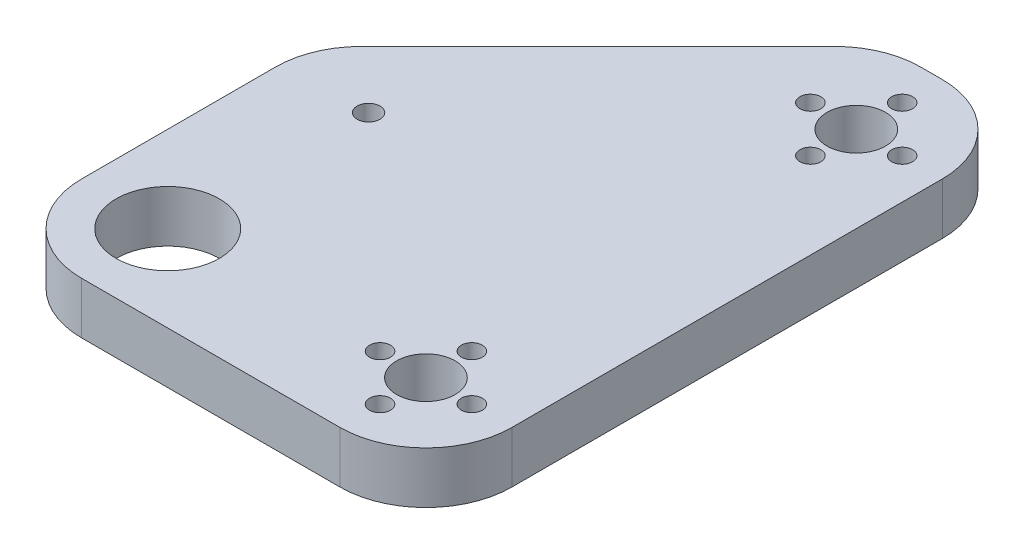
ISO-10303-21;
HEADER;
FILE_DESCRIPTION(('STEP AP214'),'2;1');
FILE_NAME('part.step','',(''),(''),'','','');
FILE_SCHEMA(('AUTOMOTIVE_DESIGN { 1 0 10303 214 1 1 1 1 }'));
ENDSEC;
DATA;
#1=APPLICATION_CONTEXT('core data for automotive mechanical design processes');
#2=APPLICATION_PROTOCOL_DEFINITION('international standard','automotive_design',2000,#1);
#3=PRODUCT_CONTEXT('',#1,'mechanical');
#4=PRODUCT('Part','Part','',(#3));
#5=PRODUCT_RELATED_PRODUCT_CATEGORY('part','',(#4));
#6=PRODUCT_DEFINITION_FORMATION('','',#4);
#7=PRODUCT_DEFINITION_CONTEXT('part definition',#1,'design');
#8=PRODUCT_DEFINITION('design','',#6,#7);
#9=PRODUCT_DEFINITION_SHAPE('','',#8);
#10=(LENGTH_UNIT() NAMED_UNIT(*) SI_UNIT(.MILLI.,.METRE.));
#11=(NAMED_UNIT(*) PLANE_ANGLE_UNIT() SI_UNIT($,.RADIAN.));
#12=(NAMED_UNIT(*) SI_UNIT($,.STERADIAN.) SOLID_ANGLE_UNIT());
#13=UNCERTAINTY_MEASURE_WITH_UNIT(LENGTH_MEASURE(1.E-05),#10,'distance_accuracy_value','');
#14=(GEOMETRIC_REPRESENTATION_CONTEXT(3) GLOBAL_UNCERTAINTY_ASSIGNED_CONTEXT((#13)) GLOBAL_UNIT_ASSIGNED_CONTEXT((#10,
#11,#12)) REPRESENTATION_CONTEXT('',''));
#15=CARTESIAN_POINT('',(0.,0.,0.));
#16=DIRECTION('',(0.,0.,1.));
#17=DIRECTION('',(1.,0.,0.));
#18=AXIS2_PLACEMENT_3D('',#15,#16,#17);
#19=CARTESIAN_POINT('',(0.,9.,0.));
#20=DIRECTION('',(1.,0.,0.));
#21=DIRECTION('',(0.,0.,-1.));
#22=AXIS2_PLACEMENT_3D('',#19,#20,#21);
#23=PLANE('',#22);
#24=DIRECTION('',(0.,0.,1.));
#25=VECTOR('',#24,1.);
#26=CARTESIAN_POINT('',(0.,9.,0.));
#27=LINE('',#26,#25);
#28=CARTESIAN_POINT('',(0.,9.,-48.7867965644036));
#29=VERTEX_POINT('',#28);
#30=CARTESIAN_POINT('',(0.,9.,-15.));
#31=VERTEX_POINT('',#30);
#32=EDGE_CURVE('E139',#29,#31,#27,.T.);
#33=ORIENTED_EDGE('',*,*,#32,.F.);
#34=DIRECTION('',(0.,1.,0.));
#35=VECTOR('',#34,1.);
#36=CARTESIAN_POINT('',(0.,0.,-48.7867965644036));
#37=LINE('',#36,#35);
#38=CARTESIAN_POINT('',(0.,0.,-48.7867965644036));
#39=VERTEX_POINT('',#38);
#40=EDGE_CURVE('E178',#29,#39,#37,.F.);
#41=ORIENTED_EDGE('',*,*,#40,.T.);
#42=DIRECTION('',(0.,0.,1.));
#43=VECTOR('',#42,1.);
#44=CARTESIAN_POINT('',(0.,0.,0.));
#45=LINE('',#44,#43);
#46=CARTESIAN_POINT('',(0.,0.,-15.));
#47=VERTEX_POINT('',#46);
#48=EDGE_CURVE('E187',#39,#47,#45,.T.);
#49=ORIENTED_EDGE('',*,*,#48,.T.);
#50=DIRECTION('',(0.,-1.,0.));
#51=VECTOR('',#50,1.);
#52=CARTESIAN_POINT('',(0.,9.,-15.));
#53=LINE('',#52,#51);
#54=EDGE_CURVE('E176',#47,#31,#53,.F.);
#55=ORIENTED_EDGE('',*,*,#54,.T.);
#56=EDGE_LOOP('',(#33,#41,#49,#55));
#57=FACE_BOUND('',#56,.T.);
#58=ADVANCED_FACE('F34',(#57),#23,.F.);
#59=CARTESIAN_POINT('',(0.,9.,0.));
#60=DIRECTION('',(0.,0.,-1.));
#61=DIRECTION('',(-1.,0.,0.));
#62=AXIS2_PLACEMENT_3D('',#59,#60,#61);
#63=PLANE('',#62);
#64=DIRECTION('',(1.,0.,0.));
#65=VECTOR('',#64,1.);
#66=CARTESIAN_POINT('',(0.,0.,0.));
#67=LINE('',#66,#65);
#68=CARTESIAN_POINT('',(15.,0.,0.));
#69=VERTEX_POINT('',#68);
#70=CARTESIAN_POINT('',(60.,0.,0.));
#71=VERTEX_POINT('',#70);
#72=EDGE_CURVE('E144',#69,#71,#67,.T.);
#73=ORIENTED_EDGE('',*,*,#72,.T.);
#74=DIRECTION('',(0.,-1.,0.));
#75=VECTOR('',#74,1.);
#76=CARTESIAN_POINT('',(60.,9.,0.));
#77=LINE('',#76,#75);
#78=CARTESIAN_POINT('',(60.,9.,0.));
#79=VERTEX_POINT('',#78);
#80=EDGE_CURVE('E11',#71,#79,#77,.F.);
#81=ORIENTED_EDGE('',*,*,#80,.T.);
#82=DIRECTION('',(1.,0.,0.));
#83=VECTOR('',#82,1.);
#84=CARTESIAN_POINT('',(0.,9.,0.));
#85=LINE('',#84,#83);
#86=CARTESIAN_POINT('',(15.,9.,0.));
#87=VERTEX_POINT('',#86);
#88=EDGE_CURVE('E142',#87,#79,#85,.T.);
#89=ORIENTED_EDGE('',*,*,#88,.F.);
#90=DIRECTION('',(0.,-1.,0.));
#91=VECTOR('',#90,1.);
#92=CARTESIAN_POINT('',(15.,9.,0.));
#93=LINE('',#92,#91);
#94=EDGE_CURVE('E42',#87,#69,#93,.T.);
#95=ORIENTED_EDGE('',*,*,#94,.T.);
#96=EDGE_LOOP('',(#73,#81,#89,#95));
#97=FACE_BOUND('',#96,.T.);
#98=ADVANCED_FACE('F183',(#97),#63,.F.);
#99=CARTESIAN_POINT('',(75.,9.,0.));
#100=DIRECTION('',(-1.,0.,0.));
#101=DIRECTION('',(0.,0.,1.));
#102=AXIS2_PLACEMENT_3D('',#99,#100,#101);
#103=PLANE('',#102);
#104=DIRECTION('',(0.,0.,-1.));
#105=VECTOR('',#104,1.);
#106=CARTESIAN_POINT('',(75.,0.,0.));
#107=LINE('',#106,#105);
#108=CARTESIAN_POINT('',(75.,0.,-15.));
#109=VERTEX_POINT('',#108);
#110=CARTESIAN_POINT('',(75.,0.,-90.));
#111=VERTEX_POINT('',#110);
#112=EDGE_CURVE('E140',#109,#111,#107,.T.);
#113=ORIENTED_EDGE('',*,*,#112,.T.);
#114=DIRECTION('',(0.,-1.,0.));
#115=VECTOR('',#114,1.);
#116=CARTESIAN_POINT('',(75.,9.,-90.));
#117=LINE('',#116,#115);
#118=CARTESIAN_POINT('',(75.,9.,-90.));
#119=VERTEX_POINT('',#118);
#120=EDGE_CURVE('E116',#111,#119,#117,.F.);
#121=ORIENTED_EDGE('',*,*,#120,.T.);
#122=DIRECTION('',(0.,0.,-1.));
#123=VECTOR('',#122,1.);
#124=CARTESIAN_POINT('',(75.,9.,0.));
#125=LINE('',#124,#123);
#126=CARTESIAN_POINT('',(75.,9.,-15.));
#127=VERTEX_POINT('',#126);
#128=EDGE_CURVE('E192',#127,#119,#125,.T.);
#129=ORIENTED_EDGE('',*,*,#128,.F.);
#130=DIRECTION('',(0.,-1.,0.));
#131=VECTOR('',#130,1.);
#132=CARTESIAN_POINT('',(75.,9.,-15.));
#133=LINE('',#132,#131);
#134=EDGE_CURVE('E121',#127,#109,#133,.T.);
#135=ORIENTED_EDGE('',*,*,#134,.T.);
#136=EDGE_LOOP('',(#113,#121,#129,#135));
#137=FACE_BOUND('',#136,.T.);
#138=ADVANCED_FACE('F292',(#137),#103,.F.);
#139=CARTESIAN_POINT('',(0.,9.,-105.));
#140=DIRECTION('',(0.,0.,1.));
#141=DIRECTION('',(1.,0.,0.));
#142=AXIS2_PLACEMENT_3D('',#139,#140,#141);
#143=PLANE('',#142);
#144=DIRECTION('',(-1.,0.,0.));
#145=VECTOR('',#144,1.);
#146=CARTESIAN_POINT('',(0.,9.,-105.));
#147=LINE('',#146,#145);
#148=CARTESIAN_POINT('',(60.,9.,-105.));
#149=VERTEX_POINT('',#148);
#150=CARTESIAN_POINT('',(56.2132034355966,9.,-105.));
#151=VERTEX_POINT('',#150);
#152=EDGE_CURVE('E132',#149,#151,#147,.T.);
#153=ORIENTED_EDGE('',*,*,#152,.F.);
#154=DIRECTION('',(0.,-1.,0.));
#155=VECTOR('',#154,1.);
#156=CARTESIAN_POINT('',(60.,9.,-105.));
#157=LINE('',#156,#155);
#158=CARTESIAN_POINT('',(60.,0.,-105.));
#159=VERTEX_POINT('',#158);
#160=EDGE_CURVE('E115',#149,#159,#157,.T.);
#161=ORIENTED_EDGE('',*,*,#160,.T.);
#162=DIRECTION('',(-1.,0.,0.));
#163=VECTOR('',#162,1.);
#164=CARTESIAN_POINT('',(0.,0.,-105.));
#165=LINE('',#164,#163);
#166=CARTESIAN_POINT('',(56.2132034355966,0.,-105.));
#167=VERTEX_POINT('',#166);
#168=EDGE_CURVE('E129',#159,#167,#165,.T.);
#169=ORIENTED_EDGE('',*,*,#168,.T.);
#170=DIRECTION('',(0.,-1.,0.));
#171=VECTOR('',#170,1.);
#172=CARTESIAN_POINT('',(56.2132034355966,9.,-105.));
#173=LINE('',#172,#171);
#174=EDGE_CURVE('E134',#167,#151,#173,.F.);
#175=ORIENTED_EDGE('',*,*,#174,.T.);
#176=EDGE_LOOP('',(#153,#161,#169,#175));
#177=FACE_BOUND('',#176,.T.);
#178=ADVANCED_FACE('F127',(#177),#143,.F.);
#179=CARTESIAN_POINT('',(0.,9.,0.));
#180=DIRECTION('',(0.,-1.,0.));
#181=DIRECTION('',(0.,0.,-1.));
#182=AXIS2_PLACEMENT_3D('',#179,#180,#181);
#183=PLANE('',#182);
#184=CARTESIAN_POINT('',(60.,9.,-98.));
#185=DIRECTION('',(0.,1.,0.));
#186=DIRECTION('',(0.,0.,1.));
#187=AXIS2_PLACEMENT_3D('',#184,#185,#186);
#188=CIRCLE('',#187,1.825);
#189=CARTESIAN_POINT('',(60.,9.,-96.175));
#190=VERTEX_POINT('',#189);
#191=EDGE_CURVE('E226',#190,#190,#188,.T.);
#192=ORIENTED_EDGE('',*,*,#191,.F.);
#193=EDGE_LOOP('',(#192));
#194=FACE_BOUND('',#193,.T.);
#195=CARTESIAN_POINT('',(60.,9.,-90.));
#196=DIRECTION('',(0.,1.,0.));
#197=DIRECTION('',(0.,0.,1.));
#198=AXIS2_PLACEMENT_3D('',#195,#196,#197);
#199=CIRCLE('',#198,5.1);
#200=CARTESIAN_POINT('',(60.,9.,-84.9));
#201=VERTEX_POINT('',#200);
#202=EDGE_CURVE('E233',#201,#201,#199,.T.);
#203=ORIENTED_EDGE('',*,*,#202,.F.);
#204=EDGE_LOOP('',(#203));
#205=FACE_BOUND('',#204,.T.);
#206=CARTESIAN_POINT('',(52.,9.,-15.));
#207=DIRECTION('',(0.,1.,0.));
#208=DIRECTION('',(0.,0.,1.));
#209=AXIS2_PLACEMENT_3D('',#206,#207,#208);
#210=CIRCLE('',#209,1.825);
#211=CARTESIAN_POINT('',(52.,9.,-13.175));
#212=VERTEX_POINT('',#211);
#213=EDGE_CURVE('E239',#212,#212,#210,.T.);
#214=ORIENTED_EDGE('',*,*,#213,.F.);
#215=EDGE_LOOP('',(#214));
#216=FACE_BOUND('',#215,.T.);
#217=CARTESIAN_POINT('',(68.,9.,-15.));
#218=DIRECTION('',(0.,1.,0.));
#219=DIRECTION('',(0.,0.,1.));
#220=AXIS2_PLACEMENT_3D('',#217,#218,#219);
#221=CIRCLE('',#220,1.82499999999999);
#222=CARTESIAN_POINT('',(68.,9.,-13.175));
#223=VERTEX_POINT('',#222);
#224=EDGE_CURVE('E245',#223,#223,#221,.T.);
#225=ORIENTED_EDGE('',*,*,#224,.F.);
#226=EDGE_LOOP('',(#225));
#227=FACE_BOUND('',#226,.T.);
#228=CARTESIAN_POINT('',(15.,9.,-50.));
#229=DIRECTION('',(0.,1.,0.));
#230=DIRECTION('',(0.,0.,1.));
#231=AXIS2_PLACEMENT_3D('',#228,#229,#230);
#232=CIRCLE('',#231,2.);
#233=CARTESIAN_POINT('',(15.,9.,-48.));
#234=VERTEX_POINT('',#233);
#235=EDGE_CURVE('E209',#234,#234,#232,.T.);
#236=ORIENTED_EDGE('',*,*,#235,.F.);
#237=EDGE_LOOP('',(#236));
#238=FACE_BOUND('',#237,.T.);
#239=CARTESIAN_POINT('',(60.,9.,-15.));
#240=DIRECTION('',(0.,1.,0.));
#241=DIRECTION('',(0.,0.,1.));
#242=AXIS2_PLACEMENT_3D('',#239,#240,#241);
#243=CIRCLE('',#242,5.1);
#244=CARTESIAN_POINT('',(60.,9.,-9.9));
#245=VERTEX_POINT('',#244);
#246=EDGE_CURVE('E202',#245,#245,#243,.T.);
#247=ORIENTED_EDGE('',*,*,#246,.F.);
#248=EDGE_LOOP('',(#247));
#249=FACE_BOUND('',#248,.T.);
#250=CARTESIAN_POINT('',(60.,9.,-23.));
#251=DIRECTION('',(0.,1.,0.));
#252=DIRECTION('',(0.,0.,1.));
#253=AXIS2_PLACEMENT_3D('',#250,#251,#252);
#254=CIRCLE('',#253,1.825);
#255=CARTESIAN_POINT('',(60.,9.,-21.175));
#256=VERTEX_POINT('',#255);
#257=EDGE_CURVE('E221',#256,#256,#254,.T.);
#258=ORIENTED_EDGE('',*,*,#257,.F.);
#259=EDGE_LOOP('',(#258));
#260=FACE_BOUND('',#259,.T.);
#261=CARTESIAN_POINT('',(60.,9.,-7.));
#262=DIRECTION('',(0.,1.,0.));
#263=DIRECTION('',(0.,0.,1.));
#264=AXIS2_PLACEMENT_3D('',#261,#262,#263);
#265=CIRCLE('',#264,1.825);
#266=CARTESIAN_POINT('',(60.,9.,-5.175));
#267=VERTEX_POINT('',#266);
#268=EDGE_CURVE('E214',#267,#267,#265,.T.);
#269=ORIENTED_EDGE('',*,*,#268,.F.);
#270=EDGE_LOOP('',(#269));
#271=FACE_BOUND('',#270,.T.);
#272=CARTESIAN_POINT('',(60.,9.,-82.));
#273=DIRECTION('',(0.,1.,0.));
#274=DIRECTION('',(0.,0.,1.));
#275=AXIS2_PLACEMENT_3D('',#272,#273,#274);
#276=CIRCLE('',#275,1.825);
#277=CARTESIAN_POINT('',(60.,9.,-80.175));
#278=VERTEX_POINT('',#277);
#279=EDGE_CURVE('E262',#278,#278,#276,.T.);
#280=ORIENTED_EDGE('',*,*,#279,.F.);
#281=EDGE_LOOP('',(#280));
#282=FACE_BOUND('',#281,.T.);
#283=CARTESIAN_POINT('',(68.,9.,-90.));
#284=DIRECTION('',(0.,1.,0.));
#285=DIRECTION('',(0.,0.,1.));
#286=AXIS2_PLACEMENT_3D('',#283,#284,#285);
#287=CIRCLE('',#286,1.82499999999999);
#288=CARTESIAN_POINT('',(68.,9.,-88.175));
#289=VERTEX_POINT('',#288);
#290=EDGE_CURVE('E256',#289,#289,#287,.T.);
#291=ORIENTED_EDGE('',*,*,#290,.F.);
#292=EDGE_LOOP('',(#291));
#293=FACE_BOUND('',#292,.T.);
#294=CARTESIAN_POINT('',(52.,9.,-90.));
#295=DIRECTION('',(0.,1.,0.));
#296=DIRECTION('',(0.,0.,1.));
#297=AXIS2_PLACEMENT_3D('',#294,#295,#296);
#298=CIRCLE('',#297,1.825);
#299=CARTESIAN_POINT('',(52.,9.,-88.175));
#300=VERTEX_POINT('',#299);
#301=EDGE_CURVE('E250',#300,#300,#298,.T.);
#302=ORIENTED_EDGE('',*,*,#301,.F.);
#303=EDGE_LOOP('',(#302));
#304=FACE_BOUND('',#303,.T.);
#305=CARTESIAN_POINT('',(15.,9.,-15.));
#306=DIRECTION('',(0.,1.,0.));
#307=DIRECTION('',(0.,0.,1.));
#308=AXIS2_PLACEMENT_3D('',#305,#306,#307);
#309=CIRCLE('',#308,9.);
#310=CARTESIAN_POINT('',(15.,9.,-6.));
#311=VERTEX_POINT('',#310);
#312=EDGE_CURVE('E196',#311,#311,#309,.T.);
#313=ORIENTED_EDGE('',*,*,#312,.F.);
#314=EDGE_LOOP('',(#313));
#315=FACE_BOUND('',#314,.T.);
#316=ORIENTED_EDGE('',*,*,#128,.T.);
#317=CARTESIAN_POINT('',(60.,9.,-90.));
#318=DIRECTION('',(0.,-1.,0.));
#319=DIRECTION('',(0.,0.,-1.));
#320=AXIS2_PLACEMENT_3D('',#317,#318,#319);
#321=CIRCLE('',#320,15.);
#322=EDGE_CURVE('E170',#119,#149,#321,.F.);
#323=ORIENTED_EDGE('',*,*,#322,.T.);
#324=ORIENTED_EDGE('',*,*,#152,.T.);
#325=CARTESIAN_POINT('',(56.2132034355966,9.,-90.));
#326=DIRECTION('',(0.,-1.,0.));
#327=DIRECTION('',(0.,0.,-1.));
#328=AXIS2_PLACEMENT_3D('',#325,#326,#327);
#329=CIRCLE('',#328,15.);
#330=CARTESIAN_POINT('',(45.6066017177984,9.,-100.606601717798));
#331=VERTEX_POINT('',#330);
#332=EDGE_CURVE('E168',#151,#331,#329,.F.);
#333=ORIENTED_EDGE('',*,*,#332,.T.);
#334=DIRECTION('',(0.707106781186549,0.,-0.707106781186546));
#335=VECTOR('',#334,1.);
#336=CARTESIAN_POINT('',(0.,9.,-55.));
#337=LINE('',#336,#335);
#338=CARTESIAN_POINT('',(4.39339828220182,9.,-59.3933982822018));
#339=VERTEX_POINT('',#338);
#340=EDGE_CURVE('E150',#331,#339,#337,.F.);
#341=ORIENTED_EDGE('',*,*,#340,.T.);
#342=CARTESIAN_POINT('',(15.,9.,-48.7867965644036));
#343=DIRECTION('',(0.,-1.,0.));
#344=DIRECTION('',(0.,0.,-1.));
#345=AXIS2_PLACEMENT_3D('',#342,#343,#344);
#346=CIRCLE('',#345,15.);
#347=EDGE_CURVE('E166',#339,#29,#346,.F.);
#348=ORIENTED_EDGE('',*,*,#347,.T.);
#349=ORIENTED_EDGE('',*,*,#32,.T.);
#350=CARTESIAN_POINT('',(15.,9.,-15.));
#351=DIRECTION('',(0.,-1.,0.));
#352=DIRECTION('',(0.,0.,-1.));
#353=AXIS2_PLACEMENT_3D('',#350,#351,#352);
#354=CIRCLE('',#353,15.);
#355=EDGE_CURVE('E54',#31,#87,#354,.F.);
#356=ORIENTED_EDGE('',*,*,#355,.T.);
#357=ORIENTED_EDGE('',*,*,#88,.T.);
#358=CARTESIAN_POINT('',(60.,9.,-15.));
#359=DIRECTION('',(0.,-1.,0.));
#360=DIRECTION('',(0.,0.,-1.));
#361=AXIS2_PLACEMENT_3D('',#358,#359,#360);
#362=CIRCLE('',#361,15.);
#363=EDGE_CURVE('E164',#79,#127,#362,.F.);
#364=ORIENTED_EDGE('',*,*,#363,.T.);
#365=EDGE_LOOP('',(#316,#323,#324,#333,#341,#348,#349,#356,#357,#364));
#366=FACE_BOUND('',#365,.T.);
#367=ADVANCED_FACE('F278',(#194,#205,#216,#227,#238,#249,#260,#271,#282,#293,#304,#315,#366),
#183,.F.);
#368=CARTESIAN_POINT('',(0.,0.,0.));
#369=DIRECTION('',(0.,-1.,0.));
#370=DIRECTION('',(0.,0.,-1.));
#371=AXIS2_PLACEMENT_3D('',#368,#369,#370);
#372=PLANE('',#371);
#373=CARTESIAN_POINT('',(60.,0.,-98.));
#374=DIRECTION('',(0.,1.,0.));
#375=DIRECTION('',(0.,0.,1.));
#376=AXIS2_PLACEMENT_3D('',#373,#374,#375);
#377=CIRCLE('',#376,1.825);
#378=CARTESIAN_POINT('',(60.,0.,-96.175));
#379=VERTEX_POINT('',#378);
#380=EDGE_CURVE('E229',#379,#379,#377,.T.);
#381=ORIENTED_EDGE('',*,*,#380,.T.);
#382=EDGE_LOOP('',(#381));
#383=FACE_BOUND('',#382,.T.);
#384=CARTESIAN_POINT('',(60.,0.,-90.));
#385=DIRECTION('',(0.,1.,0.));
#386=DIRECTION('',(0.,0.,1.));
#387=AXIS2_PLACEMENT_3D('',#384,#385,#386);
#388=CIRCLE('',#387,5.1);
#389=CARTESIAN_POINT('',(60.,0.,-84.9));
#390=VERTEX_POINT('',#389);
#391=EDGE_CURVE('E236',#390,#390,#388,.T.);
#392=ORIENTED_EDGE('',*,*,#391,.T.);
#393=EDGE_LOOP('',(#392));
#394=FACE_BOUND('',#393,.T.);
#395=CARTESIAN_POINT('',(52.,0.,-15.));
#396=DIRECTION('',(0.,1.,0.));
#397=DIRECTION('',(0.,0.,1.));
#398=AXIS2_PLACEMENT_3D('',#395,#396,#397);
#399=CIRCLE('',#398,1.825);
#400=CARTESIAN_POINT('',(52.,0.,-13.175));
#401=VERTEX_POINT('',#400);
#402=EDGE_CURVE('E242',#401,#401,#399,.T.);
#403=ORIENTED_EDGE('',*,*,#402,.T.);
#404=EDGE_LOOP('',(#403));
#405=FACE_BOUND('',#404,.T.);
#406=CARTESIAN_POINT('',(68.,0.,-15.));
#407=DIRECTION('',(0.,1.,0.));
#408=DIRECTION('',(0.,0.,1.));
#409=AXIS2_PLACEMENT_3D('',#406,#407,#408);
#410=CIRCLE('',#409,1.82499999999999);
#411=CARTESIAN_POINT('',(68.,0.,-13.175));
#412=VERTEX_POINT('',#411);
#413=EDGE_CURVE('E218',#412,#412,#410,.T.);
#414=ORIENTED_EDGE('',*,*,#413,.T.);
#415=EDGE_LOOP('',(#414));
#416=FACE_BOUND('',#415,.T.);
#417=CARTESIAN_POINT('',(15.,0.,-50.));
#418=DIRECTION('',(0.,1.,0.));
#419=DIRECTION('',(0.,0.,1.));
#420=AXIS2_PLACEMENT_3D('',#417,#418,#419);
#421=CIRCLE('',#420,2.);
#422=CARTESIAN_POINT('',(15.,0.,-48.));
#423=VERTEX_POINT('',#422);
#424=EDGE_CURVE('E199',#423,#423,#421,.T.);
#425=ORIENTED_EDGE('',*,*,#424,.T.);
#426=EDGE_LOOP('',(#425));
#427=FACE_BOUND('',#426,.T.);
#428=CARTESIAN_POINT('',(60.,0.,-15.));
#429=DIRECTION('',(0.,1.,0.));
#430=DIRECTION('',(0.,0.,1.));
#431=AXIS2_PLACEMENT_3D('',#428,#429,#430);
#432=CIRCLE('',#431,5.1);
#433=CARTESIAN_POINT('',(60.,0.,-9.9));
#434=VERTEX_POINT('',#433);
#435=EDGE_CURVE('E205',#434,#434,#432,.T.);
#436=ORIENTED_EDGE('',*,*,#435,.T.);
#437=EDGE_LOOP('',(#436));
#438=FACE_BOUND('',#437,.T.);
#439=CARTESIAN_POINT('',(60.,0.,-23.));
#440=DIRECTION('',(0.,1.,0.));
#441=DIRECTION('',(0.,0.,1.));
#442=AXIS2_PLACEMENT_3D('',#439,#440,#441);
#443=CIRCLE('',#442,1.825);
#444=CARTESIAN_POINT('',(60.,0.,-21.175));
#445=VERTEX_POINT('',#444);
#446=EDGE_CURVE('E206',#445,#445,#443,.T.);
#447=ORIENTED_EDGE('',*,*,#446,.T.);
#448=EDGE_LOOP('',(#447));
#449=FACE_BOUND('',#448,.T.);
#450=CARTESIAN_POINT('',(60.,0.,-7.));
#451=DIRECTION('',(0.,1.,0.));
#452=DIRECTION('',(0.,0.,1.));
#453=AXIS2_PLACEMENT_3D('',#450,#451,#452);
#454=CIRCLE('',#453,1.825);
#455=CARTESIAN_POINT('',(60.,0.,-5.175));
#456=VERTEX_POINT('',#455);
#457=EDGE_CURVE('E217',#456,#456,#454,.T.);
#458=ORIENTED_EDGE('',*,*,#457,.T.);
#459=EDGE_LOOP('',(#458));
#460=FACE_BOUND('',#459,.T.);
#461=CARTESIAN_POINT('',(60.,0.,-82.));
#462=DIRECTION('',(0.,1.,0.));
#463=DIRECTION('',(0.,0.,1.));
#464=AXIS2_PLACEMENT_3D('',#461,#462,#463);
#465=CIRCLE('',#464,1.825);
#466=CARTESIAN_POINT('',(60.,0.,-80.175));
#467=VERTEX_POINT('',#466);
#468=EDGE_CURVE('E230',#467,#467,#465,.T.);
#469=ORIENTED_EDGE('',*,*,#468,.T.);
#470=EDGE_LOOP('',(#469));
#471=FACE_BOUND('',#470,.T.);
#472=CARTESIAN_POINT('',(68.,0.,-90.));
#473=DIRECTION('',(0.,1.,0.));
#474=DIRECTION('',(0.,0.,1.));
#475=AXIS2_PLACEMENT_3D('',#472,#473,#474);
#476=CIRCLE('',#475,1.82499999999999);
#477=CARTESIAN_POINT('',(68.,0.,-88.175));
#478=VERTEX_POINT('',#477);
#479=EDGE_CURVE('E259',#478,#478,#476,.T.);
#480=ORIENTED_EDGE('',*,*,#479,.T.);
#481=EDGE_LOOP('',(#480));
#482=FACE_BOUND('',#481,.T.);
#483=CARTESIAN_POINT('',(52.,0.,-90.));
#484=DIRECTION('',(0.,1.,0.));
#485=DIRECTION('',(0.,0.,1.));
#486=AXIS2_PLACEMENT_3D('',#483,#484,#485);
#487=CIRCLE('',#486,1.825);
#488=CARTESIAN_POINT('',(52.,0.,-88.175));
#489=VERTEX_POINT('',#488);
#490=EDGE_CURVE('E253',#489,#489,#487,.T.);
#491=ORIENTED_EDGE('',*,*,#490,.T.);
#492=EDGE_LOOP('',(#491));
#493=FACE_BOUND('',#492,.T.);
#494=CARTESIAN_POINT('',(15.,0.,-15.));
#495=DIRECTION('',(0.,1.,0.));
#496=DIRECTION('',(0.,0.,1.));
#497=AXIS2_PLACEMENT_3D('',#494,#495,#496);
#498=CIRCLE('',#497,9.);
#499=CARTESIAN_POINT('',(15.,0.,-6.));
#500=VERTEX_POINT('',#499);
#501=EDGE_CURVE('E188',#500,#500,#498,.T.);
#502=ORIENTED_EDGE('',*,*,#501,.T.);
#503=EDGE_LOOP('',(#502));
#504=FACE_BOUND('',#503,.T.);
#505=ORIENTED_EDGE('',*,*,#168,.F.);
#506=CARTESIAN_POINT('',(60.,0.,-90.));
#507=DIRECTION('',(0.,-1.,0.));
#508=DIRECTION('',(0.,0.,-1.));
#509=AXIS2_PLACEMENT_3D('',#506,#507,#508);
#510=CIRCLE('',#509,15.);
#511=EDGE_CURVE('E111',#159,#111,#510,.T.);
#512=ORIENTED_EDGE('',*,*,#511,.T.);
#513=ORIENTED_EDGE('',*,*,#112,.F.);
#514=CARTESIAN_POINT('',(60.,0.,-15.));
#515=DIRECTION('',(0.,-1.,0.));
#516=DIRECTION('',(0.,0.,-1.));
#517=AXIS2_PLACEMENT_3D('',#514,#515,#516);
#518=CIRCLE('',#517,15.);
#519=EDGE_CURVE('E155',#109,#71,#518,.T.);
#520=ORIENTED_EDGE('',*,*,#519,.T.);
#521=ORIENTED_EDGE('',*,*,#72,.F.);
#522=CARTESIAN_POINT('',(15.,0.,-15.));
#523=DIRECTION('',(0.,-1.,0.));
#524=DIRECTION('',(0.,0.,-1.));
#525=AXIS2_PLACEMENT_3D('',#522,#523,#524);
#526=CIRCLE('',#525,15.);
#527=EDGE_CURVE('E133',#69,#47,#526,.T.);
#528=ORIENTED_EDGE('',*,*,#527,.T.);
#529=ORIENTED_EDGE('',*,*,#48,.F.);
#530=CARTESIAN_POINT('',(15.,0.,-48.7867965644036));
#531=DIRECTION('',(0.,-1.,0.));
#532=DIRECTION('',(0.,0.,-1.));
#533=AXIS2_PLACEMENT_3D('',#530,#531,#532);
#534=CIRCLE('',#533,15.);
#535=CARTESIAN_POINT('',(4.39339828220182,0.,-59.3933982822018));
#536=VERTEX_POINT('',#535);
#537=EDGE_CURVE('E157',#39,#536,#534,.T.);
#538=ORIENTED_EDGE('',*,*,#537,.T.);
#539=DIRECTION('',(-0.707106781186549,0.,0.707106781186546));
#540=VECTOR('',#539,1.);
#541=CARTESIAN_POINT('',(-27.5,0.,-27.5000000000001));
#542=LINE('',#541,#540);
#543=CARTESIAN_POINT('',(45.6066017177984,0.,-100.606601717798));
#544=VERTEX_POINT('',#543);
#545=EDGE_CURVE('E148',#536,#544,#542,.F.);
#546=ORIENTED_EDGE('',*,*,#545,.T.);
#547=CARTESIAN_POINT('',(56.2132034355966,0.,-90.));
#548=DIRECTION('',(0.,-1.,0.));
#549=DIRECTION('',(0.,0.,-1.));
#550=AXIS2_PLACEMENT_3D('',#547,#548,#549);
#551=CIRCLE('',#550,15.);
#552=EDGE_CURVE('E122',#544,#167,#551,.T.);
#553=ORIENTED_EDGE('',*,*,#552,.T.);
#554=EDGE_LOOP('',(#505,#512,#513,#520,#521,#528,#529,#538,#546,#553));
#555=FACE_BOUND('',#554,.T.);
#556=ADVANCED_FACE('F136',(#383,#394,#405,#416,#427,#438,#449,#460,#471,#482,#493,#504,#555),
#372,.T.);
#557=CARTESIAN_POINT('',(15.,0.,-15.));
#558=DIRECTION('',(0.,1.,0.));
#559=DIRECTION('',(0.,0.,1.));
#560=AXIS2_PLACEMENT_3D('',#557,#558,#559);
#561=CYLINDRICAL_SURFACE('',#560,9.);
#562=ORIENTED_EDGE('',*,*,#501,.F.);
#563=EDGE_LOOP('',(#562));
#564=FACE_BOUND('',#563,.T.);
#565=ORIENTED_EDGE('',*,*,#312,.T.);
#566=EDGE_LOOP('',(#565));
#567=FACE_BOUND('',#566,.T.);
#568=ADVANCED_FACE('F454',(#564,#567),#561,.F.);
#569=CARTESIAN_POINT('',(52.,0.,-90.));
#570=DIRECTION('',(0.,1.,0.));
#571=DIRECTION('',(0.,0.,1.));
#572=AXIS2_PLACEMENT_3D('',#569,#570,#571);
#573=CYLINDRICAL_SURFACE('',#572,1.825);
#574=ORIENTED_EDGE('',*,*,#490,.F.);
#575=EDGE_LOOP('',(#574));
#576=FACE_BOUND('',#575,.T.);
#577=ORIENTED_EDGE('',*,*,#301,.T.);
#578=EDGE_LOOP('',(#577));
#579=FACE_BOUND('',#578,.T.);
#580=ADVANCED_FACE('F445',(#576,#579),#573,.F.);
#581=CARTESIAN_POINT('',(68.,0.,-90.));
#582=DIRECTION('',(0.,1.,0.));
#583=DIRECTION('',(0.,0.,1.));
#584=AXIS2_PLACEMENT_3D('',#581,#582,#583);
#585=CYLINDRICAL_SURFACE('',#584,1.82499999999999);
#586=ORIENTED_EDGE('',*,*,#479,.F.);
#587=EDGE_LOOP('',(#586));
#588=FACE_BOUND('',#587,.T.);
#589=ORIENTED_EDGE('',*,*,#290,.T.);
#590=EDGE_LOOP('',(#589));
#591=FACE_BOUND('',#590,.T.);
#592=ADVANCED_FACE('F274',(#588,#591),#585,.F.);
#593=CARTESIAN_POINT('',(60.,0.,-82.));
#594=DIRECTION('',(0.,1.,0.));
#595=DIRECTION('',(0.,0.,1.));
#596=AXIS2_PLACEMENT_3D('',#593,#594,#595);
#597=CYLINDRICAL_SURFACE('',#596,1.825);
#598=ORIENTED_EDGE('',*,*,#468,.F.);
#599=EDGE_LOOP('',(#598));
#600=FACE_BOUND('',#599,.T.);
#601=ORIENTED_EDGE('',*,*,#279,.T.);
#602=EDGE_LOOP('',(#601));
#603=FACE_BOUND('',#602,.T.);
#604=ADVANCED_FACE('F270',(#600,#603),#597,.F.);
#605=CARTESIAN_POINT('',(60.,0.,-7.));
#606=DIRECTION('',(0.,1.,0.));
#607=DIRECTION('',(0.,0.,1.));
#608=AXIS2_PLACEMENT_3D('',#605,#606,#607);
#609=CYLINDRICAL_SURFACE('',#608,1.825);
#610=ORIENTED_EDGE('',*,*,#457,.F.);
#611=EDGE_LOOP('',(#610));
#612=FACE_BOUND('',#611,.T.);
#613=ORIENTED_EDGE('',*,*,#268,.T.);
#614=EDGE_LOOP('',(#613));
#615=FACE_BOUND('',#614,.T.);
#616=ADVANCED_FACE('F273',(#612,#615),#609,.F.);
#617=CARTESIAN_POINT('',(60.,0.,-23.));
#618=DIRECTION('',(0.,1.,0.));
#619=DIRECTION('',(0.,0.,1.));
#620=AXIS2_PLACEMENT_3D('',#617,#618,#619);
#621=CYLINDRICAL_SURFACE('',#620,1.825);
#622=ORIENTED_EDGE('',*,*,#446,.F.);
#623=EDGE_LOOP('',(#622));
#624=FACE_BOUND('',#623,.T.);
#625=ORIENTED_EDGE('',*,*,#257,.T.);
#626=EDGE_LOOP('',(#625));
#627=FACE_BOUND('',#626,.T.);
#628=ADVANCED_FACE('F415',(#624,#627),#621,.F.);
#629=CARTESIAN_POINT('',(60.,0.,-15.));
#630=DIRECTION('',(0.,1.,0.));
#631=DIRECTION('',(0.,0.,1.));
#632=AXIS2_PLACEMENT_3D('',#629,#630,#631);
#633=CYLINDRICAL_SURFACE('',#632,5.1);
#634=ORIENTED_EDGE('',*,*,#435,.F.);
#635=EDGE_LOOP('',(#634));
#636=FACE_BOUND('',#635,.T.);
#637=ORIENTED_EDGE('',*,*,#246,.T.);
#638=EDGE_LOOP('',(#637));
#639=FACE_BOUND('',#638,.T.);
#640=ADVANCED_FACE('F406',(#636,#639),#633,.F.);
#641=CARTESIAN_POINT('',(15.,0.,-50.));
#642=DIRECTION('',(0.,1.,0.));
#643=DIRECTION('',(0.,0.,1.));
#644=AXIS2_PLACEMENT_3D('',#641,#642,#643);
#645=CYLINDRICAL_SURFACE('',#644,2.);
#646=ORIENTED_EDGE('',*,*,#424,.F.);
#647=EDGE_LOOP('',(#646));
#648=FACE_BOUND('',#647,.T.);
#649=ORIENTED_EDGE('',*,*,#235,.T.);
#650=EDGE_LOOP('',(#649));
#651=FACE_BOUND('',#650,.T.);
#652=ADVANCED_FACE('F397',(#648,#651),#645,.F.);
#653=CARTESIAN_POINT('',(68.,0.,-15.));
#654=DIRECTION('',(0.,1.,0.));
#655=DIRECTION('',(0.,0.,1.));
#656=AXIS2_PLACEMENT_3D('',#653,#654,#655);
#657=CYLINDRICAL_SURFACE('',#656,1.82499999999999);
#658=ORIENTED_EDGE('',*,*,#413,.F.);
#659=EDGE_LOOP('',(#658));
#660=FACE_BOUND('',#659,.T.);
#661=ORIENTED_EDGE('',*,*,#224,.T.);
#662=EDGE_LOOP('',(#661));
#663=FACE_BOUND('',#662,.T.);
#664=ADVANCED_FACE('F388',(#660,#663),#657,.F.);
#665=CARTESIAN_POINT('',(52.,0.,-15.));
#666=DIRECTION('',(0.,1.,0.));
#667=DIRECTION('',(0.,0.,1.));
#668=AXIS2_PLACEMENT_3D('',#665,#666,#667);
#669=CYLINDRICAL_SURFACE('',#668,1.825);
#670=ORIENTED_EDGE('',*,*,#402,.F.);
#671=EDGE_LOOP('',(#670));
#672=FACE_BOUND('',#671,.T.);
#673=ORIENTED_EDGE('',*,*,#213,.T.);
#674=EDGE_LOOP('',(#673));
#675=FACE_BOUND('',#674,.T.);
#676=ADVANCED_FACE('F379',(#672,#675),#669,.F.);
#677=CARTESIAN_POINT('',(60.,0.,-90.));
#678=DIRECTION('',(0.,1.,0.));
#679=DIRECTION('',(0.,0.,1.));
#680=AXIS2_PLACEMENT_3D('',#677,#678,#679);
#681=CYLINDRICAL_SURFACE('',#680,5.1);
#682=ORIENTED_EDGE('',*,*,#391,.F.);
#683=EDGE_LOOP('',(#682));
#684=FACE_BOUND('',#683,.T.);
#685=ORIENTED_EDGE('',*,*,#202,.T.);
#686=EDGE_LOOP('',(#685));
#687=FACE_BOUND('',#686,.T.);
#688=ADVANCED_FACE('F370',(#684,#687),#681,.F.);
#689=CARTESIAN_POINT('',(60.,0.,-98.));
#690=DIRECTION('',(0.,1.,0.));
#691=DIRECTION('',(0.,0.,1.));
#692=AXIS2_PLACEMENT_3D('',#689,#690,#691);
#693=CYLINDRICAL_SURFACE('',#692,1.825);
#694=ORIENTED_EDGE('',*,*,#380,.F.);
#695=EDGE_LOOP('',(#694));
#696=FACE_BOUND('',#695,.T.);
#697=ORIENTED_EDGE('',*,*,#191,.T.);
#698=EDGE_LOOP('',(#697));
#699=FACE_BOUND('',#698,.T.);
#700=ADVANCED_FACE('F317',(#696,#699),#693,.F.);
#701=CARTESIAN_POINT('',(0.,9.,-55.));
#702=DIRECTION('',(0.707106781186546,0.,0.707106781186549));
#703=DIRECTION('',(0.,-1.,0.));
#704=AXIS2_PLACEMENT_3D('',#701,#702,#703);
#705=PLANE('',#704);
#706=ORIENTED_EDGE('',*,*,#340,.F.);
#707=DIRECTION('',(0.,1.,0.));
#708=VECTOR('',#707,1.);
#709=CARTESIAN_POINT('',(45.6066017177984,0.,-100.606601717798));
#710=LINE('',#709,#708);
#711=EDGE_CURVE('E174',#331,#544,#710,.F.);
#712=ORIENTED_EDGE('',*,*,#711,.T.);
#713=ORIENTED_EDGE('',*,*,#545,.F.);
#714=DIRECTION('',(0.,-1.,0.));
#715=VECTOR('',#714,1.);
#716=CARTESIAN_POINT('',(4.39339828220182,9.,-59.3933982822018));
#717=LINE('',#716,#715);
#718=EDGE_CURVE('E172',#536,#339,#717,.F.);
#719=ORIENTED_EDGE('',*,*,#718,.T.);
#720=EDGE_LOOP('',(#706,#712,#713,#719));
#721=FACE_BOUND('',#720,.T.);
#722=ADVANCED_FACE('F314',(#721),#705,.F.);
#723=CARTESIAN_POINT('',(60.,9.,-90.));
#724=DIRECTION('',(0.,-1.,0.));
#725=DIRECTION('',(0.,0.,-1.));
#726=AXIS2_PLACEMENT_3D('',#723,#724,#725);
#727=CYLINDRICAL_SURFACE('',#726,15.);
#728=ORIENTED_EDGE('',*,*,#322,.F.);
#729=ORIENTED_EDGE('',*,*,#120,.F.);
#730=ORIENTED_EDGE('',*,*,#511,.F.);
#731=ORIENTED_EDGE('',*,*,#160,.F.);
#732=EDGE_LOOP('',(#728,#729,#730,#731));
#733=FACE_BOUND('',#732,.T.);
#734=ADVANCED_FACE('F114',(#733),#727,.T.);
#735=CARTESIAN_POINT('',(56.2132034355966,9.,-90.));
#736=DIRECTION('',(0.,1.,0.));
#737=DIRECTION('',(0.,0.,1.));
#738=AXIS2_PLACEMENT_3D('',#735,#736,#737);
#739=CYLINDRICAL_SURFACE('',#738,15.);
#740=ORIENTED_EDGE('',*,*,#552,.F.);
#741=ORIENTED_EDGE('',*,*,#711,.F.);
#742=ORIENTED_EDGE('',*,*,#332,.F.);
#743=ORIENTED_EDGE('',*,*,#174,.F.);
#744=EDGE_LOOP('',(#740,#741,#742,#743));
#745=FACE_BOUND('',#744,.T.);
#746=ADVANCED_FACE('F301',(#745),#739,.T.);
#747=CARTESIAN_POINT('',(15.,9.,-48.7867965644036));
#748=DIRECTION('',(0.,-1.,0.));
#749=DIRECTION('',(0.,0.,-1.));
#750=AXIS2_PLACEMENT_3D('',#747,#748,#749);
#751=CYLINDRICAL_SURFACE('',#750,15.);
#752=ORIENTED_EDGE('',*,*,#347,.F.);
#753=ORIENTED_EDGE('',*,*,#718,.F.);
#754=ORIENTED_EDGE('',*,*,#537,.F.);
#755=ORIENTED_EDGE('',*,*,#40,.F.);
#756=EDGE_LOOP('',(#752,#753,#754,#755));
#757=FACE_BOUND('',#756,.T.);
#758=ADVANCED_FACE('F296',(#757),#751,.T.);
#759=CARTESIAN_POINT('',(60.,9.,-15.));
#760=DIRECTION('',(0.,-1.,0.));
#761=DIRECTION('',(0.,0.,-1.));
#762=AXIS2_PLACEMENT_3D('',#759,#760,#761);
#763=CYLINDRICAL_SURFACE('',#762,15.);
#764=ORIENTED_EDGE('',*,*,#363,.F.);
#765=ORIENTED_EDGE('',*,*,#80,.F.);
#766=ORIENTED_EDGE('',*,*,#519,.F.);
#767=ORIENTED_EDGE('',*,*,#134,.F.);
#768=EDGE_LOOP('',(#764,#765,#766,#767));
#769=FACE_BOUND('',#768,.T.);
#770=ADVANCED_FACE('F294',(#769),#763,.T.);
#771=CARTESIAN_POINT('',(15.,9.,-15.));
#772=DIRECTION('',(0.,-1.,0.));
#773=DIRECTION('',(0.,0.,-1.));
#774=AXIS2_PLACEMENT_3D('',#771,#772,#773);
#775=CYLINDRICAL_SURFACE('',#774,15.);
#776=ORIENTED_EDGE('',*,*,#355,.F.);
#777=ORIENTED_EDGE('',*,*,#54,.F.);
#778=ORIENTED_EDGE('',*,*,#527,.F.);
#779=ORIENTED_EDGE('',*,*,#94,.F.);
#780=EDGE_LOOP('',(#776,#777,#778,#779));
#781=FACE_BOUND('',#780,.T.);
#782=ADVANCED_FACE('F36',(#781),#775,.T.);
#783=CLOSED_SHELL('',(#58,#98,#138,#178,#367,#556,#568,#580,#592,#604,#616,#628,#640,#652,#664,
#676,#688,#700,#722,#734,#746,#758,#770,#782));
#784=MANIFOLD_SOLID_BREP('B2',#783);
#785=ADVANCED_BREP_SHAPE_REPRESENTATION('',(#18,#784),#14);
#786=SHAPE_DEFINITION_REPRESENTATION(#9,#785);
ENDSEC;
END-ISO-10303-21;
